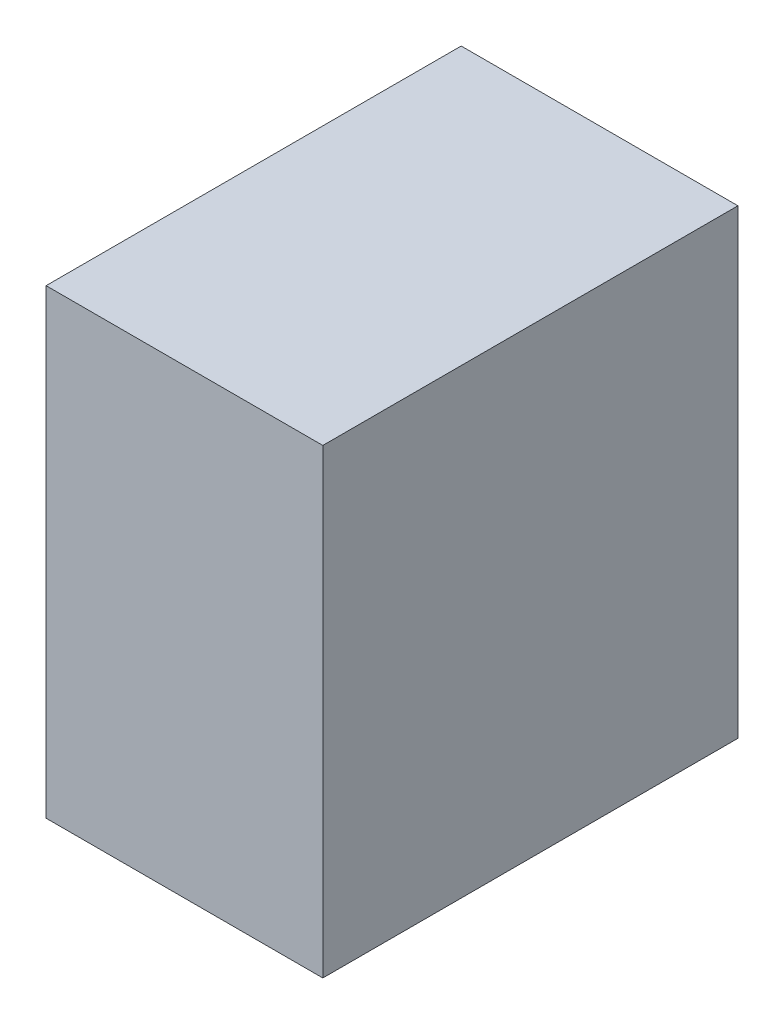
ISO-10303-21;
HEADER;
FILE_DESCRIPTION(('STEP AP214'),'2;1');
FILE_NAME('part.step','',(''),(''),'','','');
FILE_SCHEMA(('AUTOMOTIVE_DESIGN { 1 0 10303 214 1 1 1 1 }'));
ENDSEC;
DATA;
#1=APPLICATION_CONTEXT('core data for automotive mechanical design processes');
#2=APPLICATION_PROTOCOL_DEFINITION('international standard','automotive_design',2000,#1);
#3=PRODUCT_CONTEXT('',#1,'mechanical');
#4=PRODUCT('Part','Part','',(#3));
#5=PRODUCT_RELATED_PRODUCT_CATEGORY('part','',(#4));
#6=PRODUCT_DEFINITION_FORMATION('','',#4);
#7=PRODUCT_DEFINITION_CONTEXT('part definition',#1,'design');
#8=PRODUCT_DEFINITION('design','',#6,#7);
#9=PRODUCT_DEFINITION_SHAPE('','',#8);
#10=(LENGTH_UNIT() NAMED_UNIT(*) SI_UNIT(.MILLI.,.METRE.));
#11=(NAMED_UNIT(*) PLANE_ANGLE_UNIT() SI_UNIT($,.RADIAN.));
#12=(NAMED_UNIT(*) SI_UNIT($,.STERADIAN.) SOLID_ANGLE_UNIT());
#13=UNCERTAINTY_MEASURE_WITH_UNIT(LENGTH_MEASURE(1.E-05),#10,'distance_accuracy_value','');
#14=(GEOMETRIC_REPRESENTATION_CONTEXT(3) GLOBAL_UNCERTAINTY_ASSIGNED_CONTEXT((#13)) GLOBAL_UNIT_ASSIGNED_CONTEXT((#10,
#11,#12)) REPRESENTATION_CONTEXT('',''));
#15=CARTESIAN_POINT('',(0.,0.,0.));
#16=DIRECTION('',(0.,0.,1.));
#17=DIRECTION('',(1.,0.,0.));
#18=AXIS2_PLACEMENT_3D('',#15,#16,#17);
#19=CARTESIAN_POINT('',(-3.3,0.699999785812197,-3.30112145980015));
#20=DIRECTION('',(1.,0.,0.));
#21=DIRECTION('',(0.,1.,8.74227765734759E-08));
#22=AXIS2_PLACEMENT_3D('',#19,#20,#21);
#23=PLANE('',#22);
#24=DIRECTION('',(0.,8.7422776672162E-08,-0.999999999999996));
#25=VECTOR('',#24,1.);
#26=CARTESIAN_POINT('',(-3.3,0.749999702760559,-2.35112145542901));
#27=LINE('',#26,#25);
#28=CARTESIAN_POINT('',(-3.300000000001,0.74999970276056,-2.35112145543001));
#29=VERTEX_POINT('',#28);
#30=CARTESIAN_POINT('',(-3.300000000001,0.749999781442059,-3.25112145542901));
#31=VERTEX_POINT('',#30);
#32=EDGE_CURVE('E11',#29,#31,#27,.T.);
#33=ORIENTED_EDGE('',*,*,#32,.T.);
#34=DIRECTION('',(0.,0.999999999999996,8.74227765733007E-08));
#35=VECTOR('',#34,1.);
#36=CARTESIAN_POINT('',(-3.3,0.749999781441059,-3.25112145542901));
#37=LINE('',#36,#35);
#38=CARTESIAN_POINT('',(-3.300000000001,1.74999978144306,-3.25112136800523));
#39=VERTEX_POINT('',#38);
#40=EDGE_CURVE('E69',#31,#39,#37,.T.);
#41=ORIENTED_EDGE('',*,*,#40,.T.);
#42=DIRECTION('',(0.,-8.7422776672162E-08,0.999999999999996));
#43=VECTOR('',#42,1.);
#44=CARTESIAN_POINT('',(-3.3,1.74999978144306,-3.25112136800623));
#45=LINE('',#44,#43);
#46=CARTESIAN_POINT('',(-3.300000000001,1.74999970276156,-2.35112136800623));
#47=VERTEX_POINT('',#46);
#48=EDGE_CURVE('E55',#39,#47,#45,.T.);
#49=ORIENTED_EDGE('',*,*,#48,.T.);
#50=DIRECTION('',(0.,-0.999999999999996,-8.74227765733006E-08));
#51=VECTOR('',#50,1.);
#52=CARTESIAN_POINT('',(-3.3,1.74999970276256,-2.35112136800624));
#53=LINE('',#52,#51);
#54=EDGE_CURVE('E53',#47,#29,#53,.T.);
#55=ORIENTED_EDGE('',*,*,#54,.T.);
#56=EDGE_LOOP('',(#33,#41,#49,#55));
#57=FACE_BOUND('',#56,.T.);
#58=ADVANCED_FACE('F17',(#57),#23,.T.);
#59=CARTESIAN_POINT('',(-3.9,0.699999785812197,-3.30112145980015));
#60=DIRECTION('',(1.,0.,0.));
#61=DIRECTION('',(0.,1.,8.74227765734759E-08));
#62=AXIS2_PLACEMENT_3D('',#59,#60,#61);
#63=PLANE('',#62);
#64=DIRECTION('',(0.,-0.999999999999996,-8.74227765733007E-08));
#65=VECTOR('',#64,1.);
#66=CARTESIAN_POINT('',(-3.9,1.74999970276256,-2.35112136800623));
#67=LINE('',#66,#65);
#68=CARTESIAN_POINT('',(-3.899999999999,1.74999970276156,-2.35112136800623));
#69=VERTEX_POINT('',#68);
#70=CARTESIAN_POINT('',(-3.899999999999,0.74999970276056,-2.35112145543001));
#71=VERTEX_POINT('',#70);
#72=EDGE_CURVE('E24',#69,#71,#67,.T.);
#73=ORIENTED_EDGE('',*,*,#72,.F.);
#74=DIRECTION('',(0.,-8.7422776672162E-08,0.999999999999996));
#75=VECTOR('',#74,1.);
#76=CARTESIAN_POINT('',(-3.9,1.74999978144306,-3.25112136800623));
#77=LINE('',#76,#75);
#78=CARTESIAN_POINT('',(-3.899999999999,1.74999978144306,-3.25112136800523));
#79=VERTEX_POINT('',#78);
#80=EDGE_CURVE('E70',#79,#69,#77,.T.);
#81=ORIENTED_EDGE('',*,*,#80,.F.);
#82=DIRECTION('',(0.,0.999999999999996,8.74227765733007E-08));
#83=VECTOR('',#82,1.);
#84=CARTESIAN_POINT('',(-3.9,0.749999781441059,-3.25112145542901));
#85=LINE('',#84,#83);
#86=CARTESIAN_POINT('',(-3.899999999999,0.749999781442059,-3.25112145542901));
#87=VERTEX_POINT('',#86);
#88=EDGE_CURVE('E59',#87,#79,#85,.T.);
#89=ORIENTED_EDGE('',*,*,#88,.F.);
#90=DIRECTION('',(0.,8.74227765488039E-08,-0.999999999999996));
#91=VECTOR('',#90,1.);
#92=CARTESIAN_POINT('',(-3.9,0.74999970276056,-2.35112145542901));
#93=LINE('',#92,#91);
#94=EDGE_CURVE('E78',#71,#87,#93,.T.);
#95=ORIENTED_EDGE('',*,*,#94,.F.);
#96=EDGE_LOOP('',(#73,#81,#89,#95));
#97=FACE_BOUND('',#96,.T.);
#98=ADVANCED_FACE('F89',(#97),#63,.F.);
#99=CARTESIAN_POINT('',(-3.3,0.74999970276056,-2.35112145542901));
#100=DIRECTION('',(0.,1.,8.74227765734759E-08));
#101=DIRECTION('',(0.,8.74227765734759E-08,-1.));
#102=AXIS2_PLACEMENT_3D('',#99,#100,#101);
#103=PLANE('',#102);
#104=DIRECTION('',(-1.,0.,0.));
#105=VECTOR('',#104,1.);
#106=CARTESIAN_POINT('',(-3.3,0.74999970276056,-2.35112145542901));
#107=LINE('',#106,#105);
#108=EDGE_CURVE('E65',#29,#71,#107,.T.);
#109=ORIENTED_EDGE('',*,*,#108,.T.);
#110=ORIENTED_EDGE('',*,*,#94,.T.);
#111=DIRECTION('',(-1.,0.,0.));
#112=VECTOR('',#111,1.);
#113=CARTESIAN_POINT('',(-3.3,0.749999781441059,-3.25112145542901));
#114=LINE('',#113,#112);
#115=EDGE_CURVE('E66',#31,#87,#114,.T.);
#116=ORIENTED_EDGE('',*,*,#115,.F.);
#117=ORIENTED_EDGE('',*,*,#32,.F.);
#118=EDGE_LOOP('',(#109,#110,#116,#117));
#119=FACE_BOUND('',#118,.T.);
#120=ADVANCED_FACE('F63',(#119),#103,.F.);
#121=CARTESIAN_POINT('',(-3.3,0.749999781441059,-3.25112145542901));
#122=DIRECTION('',(0.,-8.74227765734759E-08,1.));
#123=DIRECTION('',(0.,1.,8.74227765734759E-08));
#124=AXIS2_PLACEMENT_3D('',#121,#122,#123);
#125=PLANE('',#124);
#126=ORIENTED_EDGE('',*,*,#115,.T.);
#127=ORIENTED_EDGE('',*,*,#88,.T.);
#128=DIRECTION('',(-1.,0.,0.));
#129=VECTOR('',#128,1.);
#130=CARTESIAN_POINT('',(-3.3,1.74999978144306,-3.25112136800623));
#131=LINE('',#130,#129);
#132=EDGE_CURVE('E60',#39,#79,#131,.T.);
#133=ORIENTED_EDGE('',*,*,#132,.F.);
#134=ORIENTED_EDGE('',*,*,#40,.F.);
#135=EDGE_LOOP('',(#126,#127,#133,#134));
#136=FACE_BOUND('',#135,.T.);
#137=ADVANCED_FACE('F91',(#136),#125,.F.);
#138=CARTESIAN_POINT('',(-3.3,1.74999978144306,-3.25112136800623));
#139=DIRECTION('',(0.,-1.,-8.74227765734759E-08));
#140=DIRECTION('',(0.,-8.74227765734759E-08,1.));
#141=AXIS2_PLACEMENT_3D('',#138,#139,#140);
#142=PLANE('',#141);
#143=ORIENTED_EDGE('',*,*,#132,.T.);
#144=ORIENTED_EDGE('',*,*,#80,.T.);
#145=DIRECTION('',(-1.,0.,0.));
#146=VECTOR('',#145,1.);
#147=CARTESIAN_POINT('',(-3.3,1.74999970276256,-2.35112136800623));
#148=LINE('',#147,#146);
#149=EDGE_CURVE('E84',#47,#69,#148,.T.);
#150=ORIENTED_EDGE('',*,*,#149,.F.);
#151=ORIENTED_EDGE('',*,*,#48,.F.);
#152=EDGE_LOOP('',(#143,#144,#150,#151));
#153=FACE_BOUND('',#152,.T.);
#154=ADVANCED_FACE('F86',(#153),#142,.F.);
#155=CARTESIAN_POINT('',(-3.3,1.74999970276256,-2.35112136800623));
#156=DIRECTION('',(0.,8.74227765734759E-08,-1.));
#157=DIRECTION('',(0.,-1.,-8.74227765734759E-08));
#158=AXIS2_PLACEMENT_3D('',#155,#156,#157);
#159=PLANE('',#158);
#160=ORIENTED_EDGE('',*,*,#149,.T.);
#161=ORIENTED_EDGE('',*,*,#72,.T.);
#162=ORIENTED_EDGE('',*,*,#108,.F.);
#163=ORIENTED_EDGE('',*,*,#54,.F.);
#164=EDGE_LOOP('',(#160,#161,#162,#163));
#165=FACE_BOUND('',#164,.T.);
#166=ADVANCED_FACE('F68',(#165),#159,.F.);
#167=CLOSED_SHELL('',(#58,#98,#120,#137,#154,#166));
#168=MANIFOLD_SOLID_BREP('B1',#167);
#169=ADVANCED_BREP_SHAPE_REPRESENTATION('',(#18,#168),#14);
#170=SHAPE_DEFINITION_REPRESENTATION(#9,#169);
ENDSEC;
END-ISO-10303-21;
